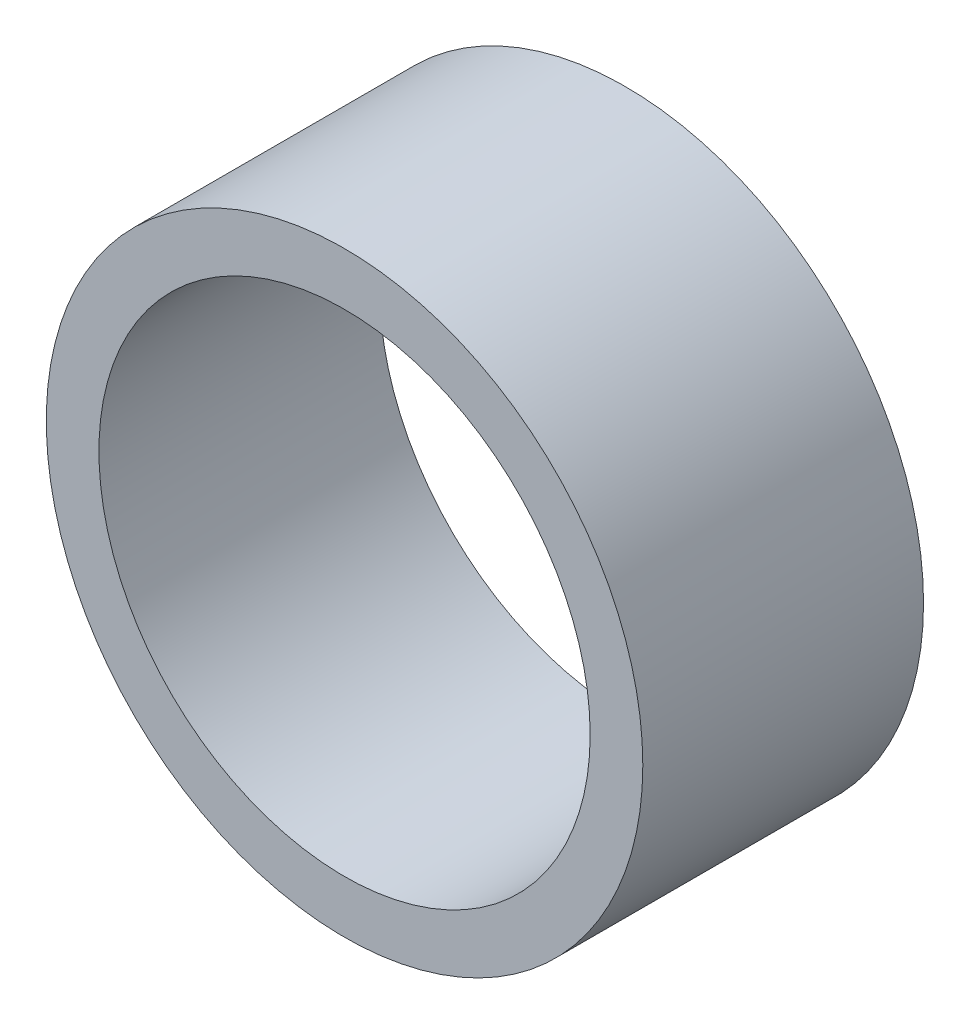
ISO-10303-21;
HEADER;
FILE_DESCRIPTION(('STEP AP214'),'2;1');
FILE_NAME('part.step','',(''),(''),'','','');
FILE_SCHEMA(('AUTOMOTIVE_DESIGN { 1 0 10303 214 1 1 1 1 }'));
ENDSEC;
DATA;
#1=APPLICATION_CONTEXT('core data for automotive mechanical design processes');
#2=APPLICATION_PROTOCOL_DEFINITION('international standard','automotive_design',2000,#1);
#3=PRODUCT_CONTEXT('',#1,'mechanical');
#4=PRODUCT('Part','Part','',(#3));
#5=PRODUCT_RELATED_PRODUCT_CATEGORY('part','',(#4));
#6=PRODUCT_DEFINITION_FORMATION('','',#4);
#7=PRODUCT_DEFINITION_CONTEXT('part definition',#1,'design');
#8=PRODUCT_DEFINITION('design','',#6,#7);
#9=PRODUCT_DEFINITION_SHAPE('','',#8);
#10=(LENGTH_UNIT() NAMED_UNIT(*) SI_UNIT(.MILLI.,.METRE.));
#11=(NAMED_UNIT(*) PLANE_ANGLE_UNIT() SI_UNIT($,.RADIAN.));
#12=(NAMED_UNIT(*) SI_UNIT($,.STERADIAN.) SOLID_ANGLE_UNIT());
#13=UNCERTAINTY_MEASURE_WITH_UNIT(LENGTH_MEASURE(1.E-05),#10,'distance_accuracy_value','');
#14=(GEOMETRIC_REPRESENTATION_CONTEXT(3) GLOBAL_UNCERTAINTY_ASSIGNED_CONTEXT((#13)) GLOBAL_UNIT_ASSIGNED_CONTEXT((#10,
#11,#12)) REPRESENTATION_CONTEXT('',''));
#15=CARTESIAN_POINT('',(0.,0.,0.));
#16=DIRECTION('',(0.,0.,1.));
#17=DIRECTION('',(1.,0.,0.));
#18=AXIS2_PLACEMENT_3D('',#15,#16,#17);
#19=CARTESIAN_POINT('',(0.,0.,8.));
#20=DIRECTION('',(0.,0.,1.));
#21=DIRECTION('',(1.,0.,0.));
#22=AXIS2_PLACEMENT_3D('',#19,#20,#21);
#23=PLANE('',#22);
#24=CARTESIAN_POINT('',(0.,0.,8.));
#25=DIRECTION('',(0.,0.,1.));
#26=DIRECTION('',(1.,0.,0.));
#27=AXIS2_PLACEMENT_3D('',#24,#25,#26);
#28=CIRCLE('',#27,8.5);
#29=CARTESIAN_POINT('',(8.5,0.,8.));
#30=VERTEX_POINT('',#29);
#31=EDGE_CURVE('E11',#30,#30,#28,.T.);
#32=ORIENTED_EDGE('',*,*,#31,.T.);
#33=EDGE_LOOP('',(#32));
#34=FACE_BOUND('',#33,.T.);
#35=CARTESIAN_POINT('',(0.,0.,8.));
#36=DIRECTION('',(0.,0.,1.));
#37=DIRECTION('',(1.,0.,0.));
#38=AXIS2_PLACEMENT_3D('',#35,#36,#37);
#39=CIRCLE('',#38,7.);
#40=CARTESIAN_POINT('',(7.,0.,8.));
#41=VERTEX_POINT('',#40);
#42=EDGE_CURVE('E51',#41,#41,#39,.T.);
#43=ORIENTED_EDGE('',*,*,#42,.F.);
#44=EDGE_LOOP('',(#43));
#45=FACE_BOUND('',#44,.T.);
#46=ADVANCED_FACE('F40',(#34,#45),#23,.T.);
#47=CARTESIAN_POINT('',(0.,0.,0.));
#48=DIRECTION('',(0.,0.,1.));
#49=DIRECTION('',(1.,0.,0.));
#50=AXIS2_PLACEMENT_3D('',#47,#48,#49);
#51=PLANE('',#50);
#52=CARTESIAN_POINT('',(0.,0.,0.));
#53=DIRECTION('',(0.,0.,1.));
#54=DIRECTION('',(1.,0.,0.));
#55=AXIS2_PLACEMENT_3D('',#52,#53,#54);
#56=CIRCLE('',#55,8.5);
#57=CARTESIAN_POINT('',(8.5,0.,0.));
#58=VERTEX_POINT('',#57);
#59=EDGE_CURVE('E44',#58,#58,#56,.T.);
#60=ORIENTED_EDGE('',*,*,#59,.F.);
#61=EDGE_LOOP('',(#60));
#62=FACE_BOUND('',#61,.T.);
#63=CARTESIAN_POINT('',(0.,0.,0.));
#64=DIRECTION('',(0.,0.,1.));
#65=DIRECTION('',(1.,0.,0.));
#66=AXIS2_PLACEMENT_3D('',#63,#64,#65);
#67=CIRCLE('',#66,7.);
#68=CARTESIAN_POINT('',(7.,0.,0.));
#69=VERTEX_POINT('',#68);
#70=EDGE_CURVE('E53',#69,#69,#67,.T.);
#71=ORIENTED_EDGE('',*,*,#70,.T.);
#72=EDGE_LOOP('',(#71));
#73=FACE_BOUND('',#72,.T.);
#74=ADVANCED_FACE('F63',(#62,#73),#51,.F.);
#75=CARTESIAN_POINT('',(0.,0.,8.));
#76=DIRECTION('',(0.,0.,-1.));
#77=DIRECTION('',(-1.,0.,0.));
#78=AXIS2_PLACEMENT_3D('',#75,#76,#77);
#79=CYLINDRICAL_SURFACE('',#78,8.5);
#80=ORIENTED_EDGE('',*,*,#31,.F.);
#81=EDGE_LOOP('',(#80));
#82=FACE_BOUND('',#81,.T.);
#83=ORIENTED_EDGE('',*,*,#59,.T.);
#84=EDGE_LOOP('',(#83));
#85=FACE_BOUND('',#84,.T.);
#86=ADVANCED_FACE('F42',(#82,#85),#79,.T.);
#87=CARTESIAN_POINT('',(0.,0.,8.));
#88=DIRECTION('',(0.,0.,-1.));
#89=DIRECTION('',(-1.,0.,0.));
#90=AXIS2_PLACEMENT_3D('',#87,#88,#89);
#91=CYLINDRICAL_SURFACE('',#90,7.);
#92=ORIENTED_EDGE('',*,*,#42,.T.);
#93=EDGE_LOOP('',(#92));
#94=FACE_BOUND('',#93,.T.);
#95=ORIENTED_EDGE('',*,*,#70,.F.);
#96=EDGE_LOOP('',(#95));
#97=FACE_BOUND('',#96,.T.);
#98=ADVANCED_FACE('F59',(#94,#97),#91,.F.);
#99=CLOSED_SHELL('',(#46,#74,#86,#98));
#100=MANIFOLD_SOLID_BREP('B2',#99);
#101=ADVANCED_BREP_SHAPE_REPRESENTATION('',(#18,#100),#14);
#102=SHAPE_DEFINITION_REPRESENTATION(#9,#101);
ENDSEC;
END-ISO-10303-21;
